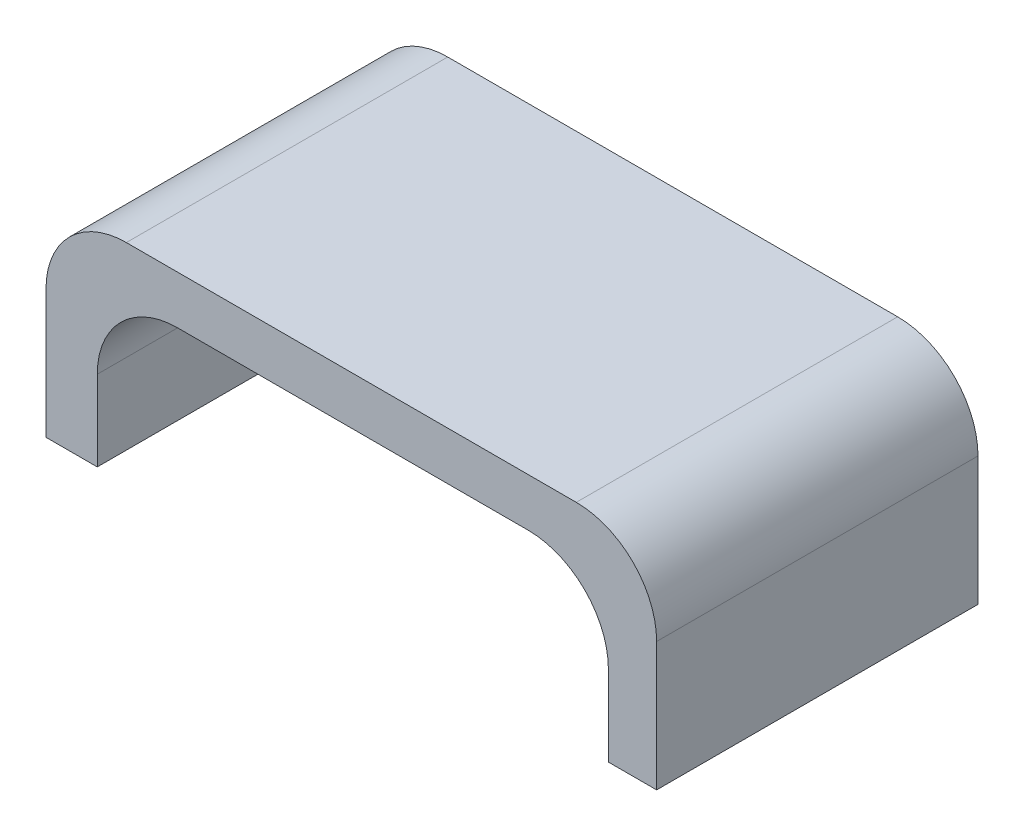
ISO-10303-21;
HEADER;
FILE_DESCRIPTION(('STEP AP214'),'2;1');
FILE_NAME('part.step','',(''),(''),'','','');
FILE_SCHEMA(('AUTOMOTIVE_DESIGN { 1 0 10303 214 1 1 1 1 }'));
ENDSEC;
DATA;
#1=APPLICATION_CONTEXT('core data for automotive mechanical design processes');
#2=APPLICATION_PROTOCOL_DEFINITION('international standard','automotive_design',2000,#1);
#3=PRODUCT_CONTEXT('',#1,'mechanical');
#4=PRODUCT('Part','Part','',(#3));
#5=PRODUCT_RELATED_PRODUCT_CATEGORY('part','',(#4));
#6=PRODUCT_DEFINITION_FORMATION('','',#4);
#7=PRODUCT_DEFINITION_CONTEXT('part definition',#1,'design');
#8=PRODUCT_DEFINITION('design','',#6,#7);
#9=PRODUCT_DEFINITION_SHAPE('','',#8);
#10=(LENGTH_UNIT() NAMED_UNIT(*) SI_UNIT(.MILLI.,.METRE.));
#11=(NAMED_UNIT(*) PLANE_ANGLE_UNIT() SI_UNIT($,.RADIAN.));
#12=(NAMED_UNIT(*) SI_UNIT($,.STERADIAN.) SOLID_ANGLE_UNIT());
#13=UNCERTAINTY_MEASURE_WITH_UNIT(LENGTH_MEASURE(1.E-05),#10,'distance_accuracy_value','');
#14=(GEOMETRIC_REPRESENTATION_CONTEXT(3) GLOBAL_UNCERTAINTY_ASSIGNED_CONTEXT((#13)) GLOBAL_UNIT_ASSIGNED_CONTEXT((#10,
#11,#12)) REPRESENTATION_CONTEXT('',''));
#15=CARTESIAN_POINT('',(0.,0.,0.));
#16=DIRECTION('',(0.,0.,1.));
#17=DIRECTION('',(1.,0.,0.));
#18=AXIS2_PLACEMENT_3D('',#15,#16,#17);
#19=CARTESIAN_POINT('',(-37.9999998133173,14.0053268917342,40.));
#20=DIRECTION('',(0.,1.,0.));
#21=DIRECTION('',(0.,0.,1.));
#22=AXIS2_PLACEMENT_3D('',#19,#20,#21);
#23=PLANE('',#22);
#24=DIRECTION('',(1.,0.,0.));
#25=VECTOR('',#24,1.);
#26=CARTESIAN_POINT('',(-37.9999998133173,14.0053268917342,0.));
#27=LINE('',#26,#25);
#28=CARTESIAN_POINT('',(-37.9999998133173,14.0053268917342,0.));
#29=VERTEX_POINT('',#28);
#30=CARTESIAN_POINT('',(-31.6160558921994,14.0053268917342,0.));
#31=VERTEX_POINT('',#30);
#32=EDGE_CURVE('E157',#29,#31,#27,.T.);
#33=ORIENTED_EDGE('',*,*,#32,.T.);
#34=DIRECTION('',(0.,0.,-1.));
#35=VECTOR('',#34,1.);
#36=CARTESIAN_POINT('',(-31.6160558921994,14.0053268917342,40.));
#37=LINE('',#36,#35);
#38=CARTESIAN_POINT('',(-31.6160558921994,14.0053268917342,40.));
#39=VERTEX_POINT('',#38);
#40=EDGE_CURVE('E11',#39,#31,#37,.T.);
#41=ORIENTED_EDGE('',*,*,#40,.F.);
#42=DIRECTION('',(1.,0.,0.));
#43=VECTOR('',#42,1.);
#44=CARTESIAN_POINT('',(-37.9999998133173,14.0053268917342,40.));
#45=LINE('',#44,#43);
#46=CARTESIAN_POINT('',(-37.9999998133173,14.0053268917342,40.));
#47=VERTEX_POINT('',#46);
#48=EDGE_CURVE('E181',#47,#39,#45,.T.);
#49=ORIENTED_EDGE('',*,*,#48,.F.);
#50=DIRECTION('',(0.,0.,-1.));
#51=VECTOR('',#50,1.);
#52=CARTESIAN_POINT('',(-37.9999998133173,14.0053268917342,40.));
#53=LINE('',#52,#51);
#54=EDGE_CURVE('E153',#47,#29,#53,.T.);
#55=ORIENTED_EDGE('',*,*,#54,.T.);
#56=EDGE_LOOP('',(#33,#41,#49,#55));
#57=FACE_BOUND('',#56,.T.);
#58=ADVANCED_FACE('F36',(#57),#23,.F.);
#59=CARTESIAN_POINT('',(-31.6160558921994,14.0053268917342,40.));
#60=DIRECTION('',(-1.,0.,0.));
#61=DIRECTION('',(0.,0.,1.));
#62=AXIS2_PLACEMENT_3D('',#59,#60,#61);
#63=PLANE('',#62);
#64=DIRECTION('',(0.,1.,0.));
#65=VECTOR('',#64,1.);
#66=CARTESIAN_POINT('',(-31.6160558921994,14.0053268917342,0.));
#67=LINE('',#66,#65);
#68=CARTESIAN_POINT('',(-31.6160558921994,23.9999999999999,0.));
#69=VERTEX_POINT('',#68);
#70=EDGE_CURVE('E160',#31,#69,#67,.T.);
#71=ORIENTED_EDGE('',*,*,#70,.T.);
#72=DIRECTION('',(0.,0.,-1.));
#73=VECTOR('',#72,1.);
#74=CARTESIAN_POINT('',(-31.6160558921994,23.9999999999999,40.));
#75=LINE('',#74,#73);
#76=CARTESIAN_POINT('',(-31.6160558921994,23.9999999999999,40.));
#77=VERTEX_POINT('',#76);
#78=EDGE_CURVE('E44',#77,#69,#75,.T.);
#79=ORIENTED_EDGE('',*,*,#78,.F.);
#80=DIRECTION('',(0.,1.,0.));
#81=VECTOR('',#80,1.);
#82=CARTESIAN_POINT('',(-31.6160558921994,14.0053268917342,40.));
#83=LINE('',#82,#81);
#84=EDGE_CURVE('E105',#39,#77,#83,.T.);
#85=ORIENTED_EDGE('',*,*,#84,.F.);
#86=ORIENTED_EDGE('',*,*,#40,.T.);
#87=EDGE_LOOP('',(#71,#79,#85,#86));
#88=FACE_BOUND('',#87,.T.);
#89=ADVANCED_FACE('F248',(#88),#63,.F.);
#90=CARTESIAN_POINT('',(-21.6160558921994,24.,40.));
#91=DIRECTION('',(0.,0.,-1.));
#92=DIRECTION('',(-1.,0.,0.));
#93=AXIS2_PLACEMENT_3D('',#90,#91,#92);
#94=CYLINDRICAL_SURFACE('',#93,10.);
#95=CARTESIAN_POINT('',(-21.6160558921994,24.,0.));
#96=DIRECTION('',(0.,0.,-1.));
#97=DIRECTION('',(-1.,0.,0.));
#98=AXIS2_PLACEMENT_3D('',#95,#96,#97);
#99=CIRCLE('',#98,10.);
#100=CARTESIAN_POINT('',(-21.6160558921993,34.,0.));
#101=VERTEX_POINT('',#100);
#102=EDGE_CURVE('E162',#69,#101,#99,.T.);
#103=ORIENTED_EDGE('',*,*,#102,.T.);
#104=DIRECTION('',(0.,0.,-1.));
#105=VECTOR('',#104,1.);
#106=CARTESIAN_POINT('',(-21.6160558921993,34.,40.));
#107=LINE('',#106,#105);
#108=CARTESIAN_POINT('',(-21.6160558921993,34.,40.));
#109=VERTEX_POINT('',#108);
#110=EDGE_CURVE('E200',#109,#101,#107,.T.);
#111=ORIENTED_EDGE('',*,*,#110,.F.);
#112=CARTESIAN_POINT('',(-21.6160558921994,24.,40.));
#113=DIRECTION('',(0.,0.,-1.));
#114=DIRECTION('',(-1.,0.,0.));
#115=AXIS2_PLACEMENT_3D('',#112,#113,#114);
#116=CIRCLE('',#115,10.);
#117=EDGE_CURVE('E208',#77,#109,#116,.T.);
#118=ORIENTED_EDGE('',*,*,#117,.F.);
#119=ORIENTED_EDGE('',*,*,#78,.T.);
#120=EDGE_LOOP('',(#103,#111,#118,#119));
#121=FACE_BOUND('',#120,.T.);
#122=ADVANCED_FACE('F206',(#121),#94,.F.);
#123=CARTESIAN_POINT('',(21.9999999999999,34.,40.));
#124=DIRECTION('',(0.,1.,0.));
#125=DIRECTION('',(-1.,0.,0.));
#126=AXIS2_PLACEMENT_3D('',#123,#124,#125);
#127=PLANE('',#126);
#128=DIRECTION('',(1.,0.,0.));
#129=VECTOR('',#128,1.);
#130=CARTESIAN_POINT('',(21.9999999999999,34.,0.));
#131=LINE('',#130,#129);
#132=CARTESIAN_POINT('',(21.9999999999999,34.,0.));
#133=VERTEX_POINT('',#132);
#134=EDGE_CURVE('E164',#101,#133,#131,.T.);
#135=ORIENTED_EDGE('',*,*,#134,.T.);
#136=DIRECTION('',(0.,0.,-1.));
#137=VECTOR('',#136,1.);
#138=CARTESIAN_POINT('',(21.9999999999999,34.,40.));
#139=LINE('',#138,#137);
#140=CARTESIAN_POINT('',(21.9999999999999,34.,40.));
#141=VERTEX_POINT('',#140);
#142=EDGE_CURVE('E197',#141,#133,#139,.T.);
#143=ORIENTED_EDGE('',*,*,#142,.F.);
#144=DIRECTION('',(1.,0.,0.));
#145=VECTOR('',#144,1.);
#146=CARTESIAN_POINT('',(21.9999999999999,34.,40.));
#147=LINE('',#146,#145);
#148=EDGE_CURVE('E224',#109,#141,#147,.T.);
#149=ORIENTED_EDGE('',*,*,#148,.F.);
#150=ORIENTED_EDGE('',*,*,#110,.T.);
#151=EDGE_LOOP('',(#135,#143,#149,#150));
#152=FACE_BOUND('',#151,.T.);
#153=ADVANCED_FACE('F215',(#152),#127,.F.);
#154=CARTESIAN_POINT('',(22.,24.,40.));
#155=DIRECTION('',(0.,0.,-1.));
#156=DIRECTION('',(-1.,0.,0.));
#157=AXIS2_PLACEMENT_3D('',#154,#155,#156);
#158=CYLINDRICAL_SURFACE('',#157,10.);
#159=CARTESIAN_POINT('',(22.,24.,0.));
#160=DIRECTION('',(0.,0.,-1.));
#161=DIRECTION('',(-1.,0.,0.));
#162=AXIS2_PLACEMENT_3D('',#159,#160,#161);
#163=CIRCLE('',#162,10.);
#164=CARTESIAN_POINT('',(32.,23.9999999999999,0.));
#165=VERTEX_POINT('',#164);
#166=EDGE_CURVE('E166',#133,#165,#163,.T.);
#167=ORIENTED_EDGE('',*,*,#166,.T.);
#168=DIRECTION('',(0.,0.,-1.));
#169=VECTOR('',#168,1.);
#170=CARTESIAN_POINT('',(32.,23.9999999999999,40.));
#171=LINE('',#170,#169);
#172=CARTESIAN_POINT('',(32.,23.9999999999999,40.));
#173=VERTEX_POINT('',#172);
#174=EDGE_CURVE('E194',#173,#165,#171,.T.);
#175=ORIENTED_EDGE('',*,*,#174,.F.);
#176=CARTESIAN_POINT('',(22.,24.,40.));
#177=DIRECTION('',(0.,0.,-1.));
#178=DIRECTION('',(-1.,0.,0.));
#179=AXIS2_PLACEMENT_3D('',#176,#177,#178);
#180=CIRCLE('',#179,10.);
#181=EDGE_CURVE('E221',#141,#173,#180,.T.);
#182=ORIENTED_EDGE('',*,*,#181,.F.);
#183=ORIENTED_EDGE('',*,*,#142,.T.);
#184=EDGE_LOOP('',(#167,#175,#182,#183));
#185=FACE_BOUND('',#184,.T.);
#186=ADVANCED_FACE('F219',(#185),#158,.F.);
#187=CARTESIAN_POINT('',(32.,14.,40.));
#188=DIRECTION('',(1.,0.,0.));
#189=DIRECTION('',(0.,0.,-1.));
#190=AXIS2_PLACEMENT_3D('',#187,#188,#189);
#191=PLANE('',#190);
#192=DIRECTION('',(0.,-1.,0.));
#193=VECTOR('',#192,1.);
#194=CARTESIAN_POINT('',(32.,14.,0.));
#195=LINE('',#194,#193);
#196=CARTESIAN_POINT('',(32.,14.,0.));
#197=VERTEX_POINT('',#196);
#198=EDGE_CURVE('E168',#165,#197,#195,.T.);
#199=ORIENTED_EDGE('',*,*,#198,.T.);
#200=DIRECTION('',(0.,0.,-1.));
#201=VECTOR('',#200,1.);
#202=CARTESIAN_POINT('',(32.,14.,40.));
#203=LINE('',#202,#201);
#204=CARTESIAN_POINT('',(32.,14.,40.));
#205=VERTEX_POINT('',#204);
#206=EDGE_CURVE('E191',#205,#197,#203,.T.);
#207=ORIENTED_EDGE('',*,*,#206,.F.);
#208=DIRECTION('',(0.,-1.,0.));
#209=VECTOR('',#208,1.);
#210=CARTESIAN_POINT('',(32.,14.,40.));
#211=LINE('',#210,#209);
#212=EDGE_CURVE('E223',#173,#205,#211,.T.);
#213=ORIENTED_EDGE('',*,*,#212,.F.);
#214=ORIENTED_EDGE('',*,*,#174,.T.);
#215=EDGE_LOOP('',(#199,#207,#213,#214));
#216=FACE_BOUND('',#215,.T.);
#217=ADVANCED_FACE('F260',(#216),#191,.F.);
#218=CARTESIAN_POINT('',(38.,14.,40.));
#219=DIRECTION('',(0.,1.,0.));
#220=DIRECTION('',(-1.,0.,0.));
#221=AXIS2_PLACEMENT_3D('',#218,#219,#220);
#222=PLANE('',#221);
#223=DIRECTION('',(1.,0.,0.));
#224=VECTOR('',#223,1.);
#225=CARTESIAN_POINT('',(38.,14.,0.));
#226=LINE('',#225,#224);
#227=CARTESIAN_POINT('',(38.,14.,0.));
#228=VERTEX_POINT('',#227);
#229=EDGE_CURVE('E170',#197,#228,#226,.T.);
#230=ORIENTED_EDGE('',*,*,#229,.T.);
#231=DIRECTION('',(0.,0.,-1.));
#232=VECTOR('',#231,1.);
#233=CARTESIAN_POINT('',(38.,14.,40.));
#234=LINE('',#233,#232);
#235=CARTESIAN_POINT('',(38.,14.,40.));
#236=VERTEX_POINT('',#235);
#237=EDGE_CURVE('E188',#236,#228,#234,.T.);
#238=ORIENTED_EDGE('',*,*,#237,.F.);
#239=DIRECTION('',(1.,0.,0.));
#240=VECTOR('',#239,1.);
#241=CARTESIAN_POINT('',(38.,14.,40.));
#242=LINE('',#241,#240);
#243=EDGE_CURVE('E226',#205,#236,#242,.T.);
#244=ORIENTED_EDGE('',*,*,#243,.F.);
#245=ORIENTED_EDGE('',*,*,#206,.T.);
#246=EDGE_LOOP('',(#230,#238,#244,#245));
#247=FACE_BOUND('',#246,.T.);
#248=ADVANCED_FACE('F263',(#247),#222,.F.);
#249=CARTESIAN_POINT('',(38.,20.,40.));
#250=DIRECTION('',(-1.,0.,0.));
#251=DIRECTION('',(0.,0.,1.));
#252=AXIS2_PLACEMENT_3D('',#249,#250,#251);
#253=PLANE('',#252);
#254=DIRECTION('',(0.,1.,0.));
#255=VECTOR('',#254,1.);
#256=CARTESIAN_POINT('',(38.,20.,0.));
#257=LINE('',#256,#255);
#258=CARTESIAN_POINT('',(38.,29.9999999999999,0.));
#259=VERTEX_POINT('',#258);
#260=EDGE_CURVE('E173',#228,#259,#257,.T.);
#261=ORIENTED_EDGE('',*,*,#260,.T.);
#262=DIRECTION('',(0.,0.,-1.));
#263=VECTOR('',#262,1.);
#264=CARTESIAN_POINT('',(38.,29.9999999999999,40.));
#265=LINE('',#264,#263);
#266=CARTESIAN_POINT('',(38.,29.9999999999999,40.));
#267=VERTEX_POINT('',#266);
#268=EDGE_CURVE('E185',#267,#259,#265,.T.);
#269=ORIENTED_EDGE('',*,*,#268,.F.);
#270=DIRECTION('',(0.,1.,0.));
#271=VECTOR('',#270,1.);
#272=CARTESIAN_POINT('',(38.,14.,40.));
#273=LINE('',#272,#271);
#274=EDGE_CURVE('E232',#236,#267,#273,.T.);
#275=ORIENTED_EDGE('',*,*,#274,.F.);
#276=ORIENTED_EDGE('',*,*,#237,.T.);
#277=EDGE_LOOP('',(#261,#269,#275,#276));
#278=FACE_BOUND('',#277,.T.);
#279=ADVANCED_FACE('F238',(#278),#253,.F.);
#280=CARTESIAN_POINT('',(28.,30.,40.));
#281=DIRECTION('',(0.,0.,-1.));
#282=DIRECTION('',(-1.,0.,0.));
#283=AXIS2_PLACEMENT_3D('',#280,#281,#282);
#284=CYLINDRICAL_SURFACE('',#283,10.);
#285=CARTESIAN_POINT('',(28.,30.,0.));
#286=DIRECTION('',(0.,0.,1.));
#287=DIRECTION('',(1.,0.,0.));
#288=AXIS2_PLACEMENT_3D('',#285,#286,#287);
#289=CIRCLE('',#288,10.);
#290=CARTESIAN_POINT('',(27.9999999999999,40.,0.));
#291=VERTEX_POINT('',#290);
#292=EDGE_CURVE('E175',#259,#291,#289,.T.);
#293=ORIENTED_EDGE('',*,*,#292,.T.);
#294=DIRECTION('',(0.,0.,-1.));
#295=VECTOR('',#294,1.);
#296=CARTESIAN_POINT('',(27.9999999999999,40.,40.));
#297=LINE('',#296,#295);
#298=CARTESIAN_POINT('',(27.9999999999999,40.,40.));
#299=VERTEX_POINT('',#298);
#300=EDGE_CURVE('E148',#299,#291,#297,.T.);
#301=ORIENTED_EDGE('',*,*,#300,.F.);
#302=CARTESIAN_POINT('',(28.,30.,40.));
#303=DIRECTION('',(0.,0.,1.));
#304=DIRECTION('',(1.,0.,0.));
#305=AXIS2_PLACEMENT_3D('',#302,#303,#304);
#306=CIRCLE('',#305,10.);
#307=EDGE_CURVE('E137',#267,#299,#306,.T.);
#308=ORIENTED_EDGE('',*,*,#307,.F.);
#309=ORIENTED_EDGE('',*,*,#268,.T.);
#310=EDGE_LOOP('',(#293,#301,#308,#309));
#311=FACE_BOUND('',#310,.T.);
#312=ADVANCED_FACE('F241',(#311),#284,.T.);
#313=CARTESIAN_POINT('',(27.9999999999999,40.,40.));
#314=DIRECTION('',(0.,-1.,0.));
#315=DIRECTION('',(0.,0.,-1.));
#316=AXIS2_PLACEMENT_3D('',#313,#314,#315);
#317=PLANE('',#316);
#318=DIRECTION('',(-1.,0.,0.));
#319=VECTOR('',#318,1.);
#320=CARTESIAN_POINT('',(27.9999999999999,40.,0.));
#321=LINE('',#320,#319);
#322=CARTESIAN_POINT('',(-27.9999998133172,40.,0.));
#323=VERTEX_POINT('',#322);
#324=EDGE_CURVE('E146',#291,#323,#321,.T.);
#325=ORIENTED_EDGE('',*,*,#324,.T.);
#326=DIRECTION('',(0.,0.,-1.));
#327=VECTOR('',#326,1.);
#328=CARTESIAN_POINT('',(-27.9999998133172,40.,40.));
#329=LINE('',#328,#327);
#330=CARTESIAN_POINT('',(-27.9999998133172,40.,40.));
#331=VERTEX_POINT('',#330);
#332=EDGE_CURVE('E143',#331,#323,#329,.T.);
#333=ORIENTED_EDGE('',*,*,#332,.F.);
#334=DIRECTION('',(-1.,0.,0.));
#335=VECTOR('',#334,1.);
#336=CARTESIAN_POINT('',(27.9999999999999,40.,40.));
#337=LINE('',#336,#335);
#338=EDGE_CURVE('E130',#299,#331,#337,.T.);
#339=ORIENTED_EDGE('',*,*,#338,.F.);
#340=ORIENTED_EDGE('',*,*,#300,.T.);
#341=EDGE_LOOP('',(#325,#333,#339,#340));
#342=FACE_BOUND('',#341,.T.);
#343=ADVANCED_FACE('F144',(#342),#317,.F.);
#344=CARTESIAN_POINT('',(-27.9999998133173,30.,40.));
#345=DIRECTION('',(0.,0.,-1.));
#346=DIRECTION('',(-1.,0.,0.));
#347=AXIS2_PLACEMENT_3D('',#344,#345,#346);
#348=CYLINDRICAL_SURFACE('',#347,10.);
#349=CARTESIAN_POINT('',(-27.9999998133173,30.,0.));
#350=DIRECTION('',(0.,0.,1.));
#351=DIRECTION('',(1.,0.,0.));
#352=AXIS2_PLACEMENT_3D('',#349,#350,#351);
#353=CIRCLE('',#352,10.);
#354=CARTESIAN_POINT('',(-37.9999998133173,29.9999999999999,0.));
#355=VERTEX_POINT('',#354);
#356=EDGE_CURVE('E178',#323,#355,#353,.T.);
#357=ORIENTED_EDGE('',*,*,#356,.T.);
#358=DIRECTION('',(0.,0.,-1.));
#359=VECTOR('',#358,1.);
#360=CARTESIAN_POINT('',(-37.9999998133173,29.9999999999999,40.));
#361=LINE('',#360,#359);
#362=CARTESIAN_POINT('',(-37.9999998133173,29.9999999999999,40.));
#363=VERTEX_POINT('',#362);
#364=EDGE_CURVE('E149',#363,#355,#361,.T.);
#365=ORIENTED_EDGE('',*,*,#364,.F.);
#366=CARTESIAN_POINT('',(-27.9999998133173,30.,40.));
#367=DIRECTION('',(0.,0.,1.));
#368=DIRECTION('',(1.,0.,0.));
#369=AXIS2_PLACEMENT_3D('',#366,#367,#368);
#370=CIRCLE('',#369,10.);
#371=EDGE_CURVE('E134',#331,#363,#370,.T.);
#372=ORIENTED_EDGE('',*,*,#371,.F.);
#373=ORIENTED_EDGE('',*,*,#332,.T.);
#374=EDGE_LOOP('',(#357,#365,#372,#373));
#375=FACE_BOUND('',#374,.T.);
#376=ADVANCED_FACE('F151',(#375),#348,.T.);
#377=CARTESIAN_POINT('',(-37.9999998133173,14.0053268917342,40.));
#378=DIRECTION('',(1.,0.,0.));
#379=DIRECTION('',(0.,0.,-1.));
#380=AXIS2_PLACEMENT_3D('',#377,#378,#379);
#381=PLANE('',#380);
#382=DIRECTION('',(0.,-1.,0.));
#383=VECTOR('',#382,1.);
#384=CARTESIAN_POINT('',(-37.9999998133173,14.0053268917342,0.));
#385=LINE('',#384,#383);
#386=EDGE_CURVE('E93',#355,#29,#385,.T.);
#387=ORIENTED_EDGE('',*,*,#386,.T.);
#388=ORIENTED_EDGE('',*,*,#54,.F.);
#389=DIRECTION('',(0.,-1.,0.));
#390=VECTOR('',#389,1.);
#391=CARTESIAN_POINT('',(-37.9999998133173,29.9999999999999,40.));
#392=LINE('',#391,#390);
#393=EDGE_CURVE('E52',#363,#47,#392,.T.);
#394=ORIENTED_EDGE('',*,*,#393,.F.);
#395=ORIENTED_EDGE('',*,*,#364,.T.);
#396=EDGE_LOOP('',(#387,#388,#394,#395));
#397=FACE_BOUND('',#396,.T.);
#398=ADVANCED_FACE('F242',(#397),#381,.F.);
#399=CARTESIAN_POINT('',(-21.6160558921994,24.,40.));
#400=DIRECTION('',(0.,0.,-1.));
#401=DIRECTION('',(-1.,0.,0.));
#402=AXIS2_PLACEMENT_3D('',#399,#400,#401);
#403=PLANE('',#402);
#404=ORIENTED_EDGE('',*,*,#48,.T.);
#405=ORIENTED_EDGE('',*,*,#84,.T.);
#406=ORIENTED_EDGE('',*,*,#117,.T.);
#407=ORIENTED_EDGE('',*,*,#148,.T.);
#408=ORIENTED_EDGE('',*,*,#181,.T.);
#409=ORIENTED_EDGE('',*,*,#212,.T.);
#410=ORIENTED_EDGE('',*,*,#243,.T.);
#411=ORIENTED_EDGE('',*,*,#274,.T.);
#412=ORIENTED_EDGE('',*,*,#307,.T.);
#413=ORIENTED_EDGE('',*,*,#338,.T.);
#414=ORIENTED_EDGE('',*,*,#371,.T.);
#415=ORIENTED_EDGE('',*,*,#393,.T.);
#416=EDGE_LOOP('',(#404,#405,#406,#407,#408,#409,#410,#411,#412,#413,#414,#415));
#417=FACE_BOUND('',#416,.T.);
#418=ADVANCED_FACE('F132',(#417),#403,.F.);
#419=CARTESIAN_POINT('',(-21.6160558921994,24.,0.));
#420=DIRECTION('',(0.,0.,-1.));
#421=DIRECTION('',(-1.,0.,0.));
#422=AXIS2_PLACEMENT_3D('',#419,#420,#421);
#423=PLANE('',#422);
#424=ORIENTED_EDGE('',*,*,#32,.F.);
#425=ORIENTED_EDGE('',*,*,#386,.F.);
#426=ORIENTED_EDGE('',*,*,#356,.F.);
#427=ORIENTED_EDGE('',*,*,#324,.F.);
#428=ORIENTED_EDGE('',*,*,#292,.F.);
#429=ORIENTED_EDGE('',*,*,#260,.F.);
#430=ORIENTED_EDGE('',*,*,#229,.F.);
#431=ORIENTED_EDGE('',*,*,#198,.F.);
#432=ORIENTED_EDGE('',*,*,#166,.F.);
#433=ORIENTED_EDGE('',*,*,#134,.F.);
#434=ORIENTED_EDGE('',*,*,#102,.F.);
#435=ORIENTED_EDGE('',*,*,#70,.F.);
#436=EDGE_LOOP('',(#424,#425,#426,#427,#428,#429,#430,#431,#432,#433,#434,#435));
#437=FACE_BOUND('',#436,.T.);
#438=ADVANCED_FACE('F210',(#437),#423,.T.);
#439=CLOSED_SHELL('',(#58,#89,#122,#153,#186,#217,#248,#279,#312,#343,#376,#398,#418,#438));
#440=MANIFOLD_SOLID_BREP('B2',#439);
#441=ADVANCED_BREP_SHAPE_REPRESENTATION('',(#18,#440),#14);
#442=SHAPE_DEFINITION_REPRESENTATION(#9,#441);
ENDSEC;
END-ISO-10303-21;
